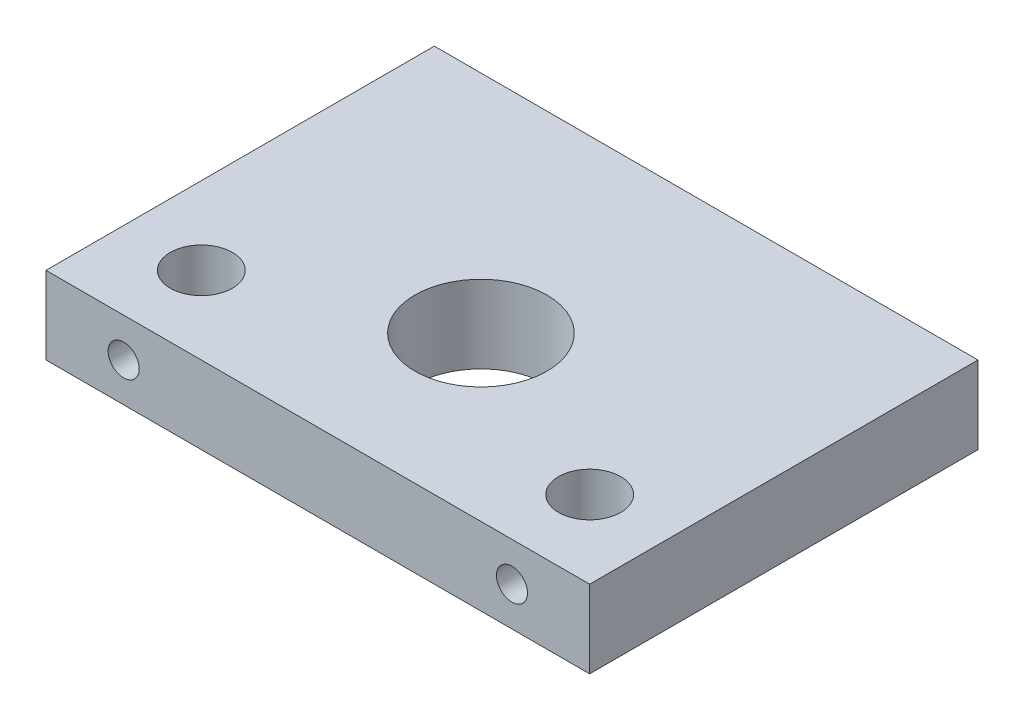
ISO-10303-21;
HEADER;
FILE_DESCRIPTION(('STEP AP214'),'2;1');
FILE_NAME('part.step','',(''),(''),'','','');
FILE_SCHEMA(('AUTOMOTIVE_DESIGN { 1 0 10303 214 1 1 1 1 }'));
ENDSEC;
DATA;
#1=APPLICATION_CONTEXT('core data for automotive mechanical design processes');
#2=APPLICATION_PROTOCOL_DEFINITION('international standard','automotive_design',2000,#1);
#3=PRODUCT_CONTEXT('',#1,'mechanical');
#4=PRODUCT('Part','Part','',(#3));
#5=PRODUCT_RELATED_PRODUCT_CATEGORY('part','',(#4));
#6=PRODUCT_DEFINITION_FORMATION('','',#4);
#7=PRODUCT_DEFINITION_CONTEXT('part definition',#1,'design');
#8=PRODUCT_DEFINITION('design','',#6,#7);
#9=PRODUCT_DEFINITION_SHAPE('','',#8);
#10=(LENGTH_UNIT() NAMED_UNIT(*) SI_UNIT(.MILLI.,.METRE.));
#11=(NAMED_UNIT(*) PLANE_ANGLE_UNIT() SI_UNIT($,.RADIAN.));
#12=(NAMED_UNIT(*) SI_UNIT($,.STERADIAN.) SOLID_ANGLE_UNIT());
#13=UNCERTAINTY_MEASURE_WITH_UNIT(LENGTH_MEASURE(1.E-05),#10,'distance_accuracy_value','');
#14=(GEOMETRIC_REPRESENTATION_CONTEXT(3) GLOBAL_UNCERTAINTY_ASSIGNED_CONTEXT((#13)) GLOBAL_UNIT_ASSIGNED_CONTEXT((#10,
#11,#12)) REPRESENTATION_CONTEXT('',''));
#15=CARTESIAN_POINT('',(0.,0.,0.));
#16=DIRECTION('',(0.,0.,1.));
#17=DIRECTION('',(1.,0.,0.));
#18=AXIS2_PLACEMENT_3D('',#15,#16,#17);
#19=CARTESIAN_POINT('',(-35.,10.,25.));
#20=DIRECTION('',(1.,0.,0.));
#21=DIRECTION('',(0.,0.,-1.));
#22=AXIS2_PLACEMENT_3D('',#19,#20,#21);
#23=PLANE('',#22);
#24=DIRECTION('',(0.,0.,1.));
#25=VECTOR('',#24,1.);
#26=CARTESIAN_POINT('',(-35.,0.,25.));
#27=LINE('',#26,#25);
#28=CARTESIAN_POINT('',(-35.,0.,-25.));
#29=VERTEX_POINT('',#28);
#30=CARTESIAN_POINT('',(-35.,0.,25.));
#31=VERTEX_POINT('',#30);
#32=EDGE_CURVE('E108',#29,#31,#27,.T.);
#33=ORIENTED_EDGE('',*,*,#32,.T.);
#34=DIRECTION('',(0.,-1.,0.));
#35=VECTOR('',#34,1.);
#36=CARTESIAN_POINT('',(-35.,10.,25.));
#37=LINE('',#36,#35);
#38=CARTESIAN_POINT('',(-35.,10.,25.));
#39=VERTEX_POINT('',#38);
#40=EDGE_CURVE('E11',#39,#31,#37,.T.);
#41=ORIENTED_EDGE('',*,*,#40,.F.);
#42=DIRECTION('',(0.,0.,1.));
#43=VECTOR('',#42,1.);
#44=CARTESIAN_POINT('',(-35.,10.,25.));
#45=LINE('',#44,#43);
#46=CARTESIAN_POINT('',(-35.,10.,-25.));
#47=VERTEX_POINT('',#46);
#48=EDGE_CURVE('E95',#47,#39,#45,.T.);
#49=ORIENTED_EDGE('',*,*,#48,.F.);
#50=DIRECTION('',(0.,-1.,0.));
#51=VECTOR('',#50,1.);
#52=CARTESIAN_POINT('',(-35.,10.,-25.));
#53=LINE('',#52,#51);
#54=EDGE_CURVE('E104',#47,#29,#53,.T.);
#55=ORIENTED_EDGE('',*,*,#54,.T.);
#56=EDGE_LOOP('',(#33,#41,#49,#55));
#57=FACE_BOUND('',#56,.T.);
#58=ADVANCED_FACE('F37',(#57),#23,.F.);
#59=CARTESIAN_POINT('',(35.,10.,25.));
#60=DIRECTION('',(0.,0.,-1.));
#61=DIRECTION('',(-1.,0.,0.));
#62=AXIS2_PLACEMENT_3D('',#59,#60,#61);
#63=PLANE('',#62);
#64=CARTESIAN_POINT('',(25.,5.,25.));
#65=DIRECTION('',(0.,0.,1.));
#66=DIRECTION('',(1.,0.,0.));
#67=AXIS2_PLACEMENT_3D('',#64,#65,#66);
#68=CIRCLE('',#67,2.);
#69=CARTESIAN_POINT('',(27.,5.,25.));
#70=VERTEX_POINT('',#69);
#71=EDGE_CURVE('E123',#70,#70,#68,.T.);
#72=ORIENTED_EDGE('',*,*,#71,.F.);
#73=EDGE_LOOP('',(#72));
#74=FACE_BOUND('',#73,.T.);
#75=CARTESIAN_POINT('',(-25.,5.00000000000002,25.));
#76=DIRECTION('',(0.,0.,1.));
#77=DIRECTION('',(-1.,0.,0.));
#78=AXIS2_PLACEMENT_3D('',#75,#76,#77);
#79=CIRCLE('',#78,2.);
#80=CARTESIAN_POINT('',(-27.,5.00000000000002,25.));
#81=VERTEX_POINT('',#80);
#82=EDGE_CURVE('E257',#81,#81,#79,.T.);
#83=ORIENTED_EDGE('',*,*,#82,.F.);
#84=EDGE_LOOP('',(#83));
#85=FACE_BOUND('',#84,.T.);
#86=DIRECTION('',(1.,0.,0.));
#87=VECTOR('',#86,1.);
#88=CARTESIAN_POINT('',(35.,0.,25.));
#89=LINE('',#88,#87);
#90=CARTESIAN_POINT('',(35.,0.,25.));
#91=VERTEX_POINT('',#90);
#92=EDGE_CURVE('E99',#31,#91,#89,.T.);
#93=ORIENTED_EDGE('',*,*,#92,.T.);
#94=DIRECTION('',(0.,-1.,0.));
#95=VECTOR('',#94,1.);
#96=CARTESIAN_POINT('',(35.,10.,25.));
#97=LINE('',#96,#95);
#98=CARTESIAN_POINT('',(35.,10.,25.));
#99=VERTEX_POINT('',#98);
#100=EDGE_CURVE('E51',#99,#91,#97,.T.);
#101=ORIENTED_EDGE('',*,*,#100,.F.);
#102=DIRECTION('',(1.,0.,0.));
#103=VECTOR('',#102,1.);
#104=CARTESIAN_POINT('',(35.,10.,25.));
#105=LINE('',#104,#103);
#106=EDGE_CURVE('E90',#39,#99,#105,.T.);
#107=ORIENTED_EDGE('',*,*,#106,.F.);
#108=ORIENTED_EDGE('',*,*,#40,.T.);
#109=EDGE_LOOP('',(#93,#101,#107,#108));
#110=FACE_BOUND('',#109,.T.);
#111=ADVANCED_FACE('F98',(#74,#85,#110),#63,.F.);
#112=CARTESIAN_POINT('',(35.,10.,25.));
#113=DIRECTION('',(-1.,0.,0.));
#114=DIRECTION('',(0.,0.,1.));
#115=AXIS2_PLACEMENT_3D('',#112,#113,#114);
#116=PLANE('',#115);
#117=DIRECTION('',(0.,0.,-1.));
#118=VECTOR('',#117,1.);
#119=CARTESIAN_POINT('',(35.,0.,25.));
#120=LINE('',#119,#118);
#121=CARTESIAN_POINT('',(35.,0.,-25.));
#122=VERTEX_POINT('',#121);
#123=EDGE_CURVE('E77',#91,#122,#120,.T.);
#124=ORIENTED_EDGE('',*,*,#123,.T.);
#125=DIRECTION('',(0.,-1.,0.));
#126=VECTOR('',#125,1.);
#127=CARTESIAN_POINT('',(35.,10.,-25.));
#128=LINE('',#127,#126);
#129=CARTESIAN_POINT('',(35.,10.,-25.));
#130=VERTEX_POINT('',#129);
#131=EDGE_CURVE('E100',#130,#122,#128,.T.);
#132=ORIENTED_EDGE('',*,*,#131,.F.);
#133=DIRECTION('',(0.,0.,-1.));
#134=VECTOR('',#133,1.);
#135=CARTESIAN_POINT('',(35.,10.,25.));
#136=LINE('',#135,#134);
#137=EDGE_CURVE('E93',#99,#130,#136,.T.);
#138=ORIENTED_EDGE('',*,*,#137,.F.);
#139=ORIENTED_EDGE('',*,*,#100,.T.);
#140=EDGE_LOOP('',(#124,#132,#138,#139));
#141=FACE_BOUND('',#140,.T.);
#142=ADVANCED_FACE('F102',(#141),#116,.F.);
#143=CARTESIAN_POINT('',(35.,10.,-25.));
#144=DIRECTION('',(0.,0.,1.));
#145=DIRECTION('',(1.,0.,0.));
#146=AXIS2_PLACEMENT_3D('',#143,#144,#145);
#147=PLANE('',#146);
#148=DIRECTION('',(-1.,0.,0.));
#149=VECTOR('',#148,1.);
#150=CARTESIAN_POINT('',(35.,0.,-25.));
#151=LINE('',#150,#149);
#152=EDGE_CURVE('E83',#122,#29,#151,.T.);
#153=ORIENTED_EDGE('',*,*,#152,.T.);
#154=ORIENTED_EDGE('',*,*,#54,.F.);
#155=DIRECTION('',(-1.,0.,0.));
#156=VECTOR('',#155,1.);
#157=CARTESIAN_POINT('',(35.,10.,-25.));
#158=LINE('',#157,#156);
#159=EDGE_CURVE('E60',#130,#47,#158,.T.);
#160=ORIENTED_EDGE('',*,*,#159,.F.);
#161=ORIENTED_EDGE('',*,*,#131,.T.);
#162=EDGE_LOOP('',(#153,#154,#160,#161));
#163=FACE_BOUND('',#162,.T.);
#164=ADVANCED_FACE('F160',(#163),#147,.F.);
#165=CARTESIAN_POINT('',(0.,10.,0.));
#166=DIRECTION('',(0.,1.,0.));
#167=DIRECTION('',(0.,0.,1.));
#168=AXIS2_PLACEMENT_3D('',#165,#166,#167);
#169=PLANE('',#168);
#170=CARTESIAN_POINT('',(5.15281762734335E-13,10.,4.));
#171=DIRECTION('',(0.,-1.,0.));
#172=DIRECTION('',(0.,0.,-1.));
#173=AXIS2_PLACEMENT_3D('',#170,#171,#172);
#174=CIRCLE('',#173,8.50000000000002);
#175=CARTESIAN_POINT('',(5.15281762734335E-13,10.,-4.50000000000001));
#176=VERTEX_POINT('',#175);
#177=EDGE_CURVE('E260',#176,#176,#174,.T.);
#178=ORIENTED_EDGE('',*,*,#177,.T.);
#179=EDGE_LOOP('',(#178));
#180=FACE_BOUND('',#179,.T.);
#181=CARTESIAN_POINT('',(-25.,10.,15.));
#182=DIRECTION('',(0.,-1.,0.));
#183=DIRECTION('',(0.,0.,-1.));
#184=AXIS2_PLACEMENT_3D('',#181,#182,#183);
#185=CIRCLE('',#184,4.);
#186=CARTESIAN_POINT('',(-25.,10.,11.));
#187=VERTEX_POINT('',#186);
#188=EDGE_CURVE('E111',#187,#187,#185,.T.);
#189=ORIENTED_EDGE('',*,*,#188,.T.);
#190=EDGE_LOOP('',(#189));
#191=FACE_BOUND('',#190,.T.);
#192=CARTESIAN_POINT('',(25.,10.,15.));
#193=DIRECTION('',(0.,-1.,0.));
#194=DIRECTION('',(0.,0.,1.));
#195=AXIS2_PLACEMENT_3D('',#192,#193,#194);
#196=CIRCLE('',#195,4.);
#197=CARTESIAN_POINT('',(25.,10.,19.));
#198=VERTEX_POINT('',#197);
#199=EDGE_CURVE('E239',#198,#198,#196,.T.);
#200=ORIENTED_EDGE('',*,*,#199,.T.);
#201=EDGE_LOOP('',(#200));
#202=FACE_BOUND('',#201,.T.);
#203=ORIENTED_EDGE('',*,*,#48,.T.);
#204=ORIENTED_EDGE('',*,*,#106,.T.);
#205=ORIENTED_EDGE('',*,*,#137,.T.);
#206=ORIENTED_EDGE('',*,*,#159,.T.);
#207=EDGE_LOOP('',(#203,#204,#205,#206));
#208=FACE_BOUND('',#207,.T.);
#209=ADVANCED_FACE('F91',(#180,#191,#202,#208),#169,.T.);
#210=CARTESIAN_POINT('',(0.,0.,0.));
#211=DIRECTION('',(0.,1.,0.));
#212=DIRECTION('',(0.,0.,1.));
#213=AXIS2_PLACEMENT_3D('',#210,#211,#212);
#214=PLANE('',#213);
#215=CARTESIAN_POINT('',(5.15281762734335E-13,0.,4.));
#216=DIRECTION('',(0.,-1.,0.));
#217=DIRECTION('',(0.,0.,-1.));
#218=AXIS2_PLACEMENT_3D('',#215,#216,#217);
#219=CIRCLE('',#218,8.50000000000002);
#220=CARTESIAN_POINT('',(5.15281762734335E-13,0.,-4.50000000000001));
#221=VERTEX_POINT('',#220);
#222=EDGE_CURVE('E263',#221,#221,#219,.T.);
#223=ORIENTED_EDGE('',*,*,#222,.F.);
#224=EDGE_LOOP('',(#223));
#225=FACE_BOUND('',#224,.T.);
#226=CARTESIAN_POINT('',(-25.,0.,15.));
#227=DIRECTION('',(0.,-1.,0.));
#228=DIRECTION('',(0.,0.,-1.));
#229=AXIS2_PLACEMENT_3D('',#226,#227,#228);
#230=CIRCLE('',#229,4.);
#231=CARTESIAN_POINT('',(-25.,0.,11.));
#232=VERTEX_POINT('',#231);
#233=EDGE_CURVE('E238',#232,#232,#230,.T.);
#234=ORIENTED_EDGE('',*,*,#233,.F.);
#235=EDGE_LOOP('',(#234));
#236=FACE_BOUND('',#235,.T.);
#237=CARTESIAN_POINT('',(25.,0.,15.));
#238=DIRECTION('',(0.,-1.,0.));
#239=DIRECTION('',(0.,0.,1.));
#240=AXIS2_PLACEMENT_3D('',#237,#238,#239);
#241=CIRCLE('',#240,4.);
#242=CARTESIAN_POINT('',(25.,0.,19.));
#243=VERTEX_POINT('',#242);
#244=EDGE_CURVE('E243',#243,#243,#241,.T.);
#245=ORIENTED_EDGE('',*,*,#244,.F.);
#246=EDGE_LOOP('',(#245));
#247=FACE_BOUND('',#246,.T.);
#248=ORIENTED_EDGE('',*,*,#32,.F.);
#249=ORIENTED_EDGE('',*,*,#152,.F.);
#250=ORIENTED_EDGE('',*,*,#123,.F.);
#251=ORIENTED_EDGE('',*,*,#92,.F.);
#252=EDGE_LOOP('',(#248,#249,#250,#251));
#253=FACE_BOUND('',#252,.T.);
#254=ADVANCED_FACE('F150',(#225,#236,#247,#253),#214,.F.);
#255=CARTESIAN_POINT('',(25.,10.,15.));
#256=DIRECTION('',(0.,-1.,0.));
#257=DIRECTION('',(0.,0.,-1.));
#258=AXIS2_PLACEMENT_3D('',#255,#256,#257);
#259=CYLINDRICAL_SURFACE('',#258,4.);
#260=CARTESIAN_POINT('',(27.,5.,18.4641016151378));
#261=CARTESIAN_POINT('',(26.9999915874878,5.10421320547434,18.4641118571589));
#262=CARTESIAN_POINT('',(26.9917996361044,5.2085621765338,18.4688763354498));
#263=CARTESIAN_POINT('',(26.9594467258005,5.4140551772306,18.4872470166907));
#264=CARTESIAN_POINT('',(26.9352522109566,5.51519200324776,18.5008717978818));
#265=CARTESIAN_POINT('',(26.8721998159803,5.71090315644693,18.5349870149));
#266=CARTESIAN_POINT('',(26.8334198829596,5.80550925884925,18.5554408906917));
#267=CARTESIAN_POINT('',(26.7425350724514,5.98684845047615,18.6008532729113));
#268=CARTESIAN_POINT('',(26.6904294741014,6.07358111343677,18.6258120230125));
#269=CARTESIAN_POINT('',(26.569333074538,6.24461144313338,18.6799373881929));
#270=CARTESIAN_POINT('',(26.4993040705353,6.32811826759177,18.709281274651));
#271=CARTESIAN_POINT('',(26.346507616982,6.4828167805706,18.7674396538212));
#272=CARTESIAN_POINT('',(26.2637338520484,6.55400232620397,18.7962538761026));
#273=CARTESIAN_POINT('',(26.0809791263127,6.68673430118849,18.8524295396166));
#274=CARTESIAN_POINT('',(25.9802143778872,6.74730753542331,18.8795621285125));
#275=CARTESIAN_POINT('',(25.7683140533369,6.85028170678709,18.9270151218417));
#276=CARTESIAN_POINT('',(25.657185076312,6.8926941123508,18.9473398236363));
#277=CARTESIAN_POINT('',(25.4360898878188,6.95500932253117,18.9776092249205));
#278=CARTESIAN_POINT('',(25.3266035809688,6.9762990526921,18.9881896044274));
#279=CARTESIAN_POINT('',(25.1051412574046,7.00033223736903,19.0001516769118));
#280=CARTESIAN_POINT('',(24.9931667883148,7.00308691359628,19.0015389356894));
#281=CARTESIAN_POINT('',(24.7803349511504,6.99050665205486,18.9952596383313));
#282=CARTESIAN_POINT('',(24.6793576016459,6.97672396895636,18.9883699178438));
#283=CARTESIAN_POINT('',(24.4813724561639,6.93423831219188,18.9674849051944));
#284=CARTESIAN_POINT('',(24.3843649578123,6.90553422204787,18.9534890813277));
#285=CARTESIAN_POINT('',(24.1953812168607,6.83383486782005,18.9194316657533));
#286=CARTESIAN_POINT('',(24.1034931529696,6.79064737365578,18.899288830584));
#287=CARTESIAN_POINT('',(23.9280463969734,6.6914731675971,18.8547529197337));
#288=CARTESIAN_POINT('',(23.8444907023227,6.63548187339532,18.8303583231497));
#289=CARTESIAN_POINT('',(23.6796526782036,6.50620929693394,18.7768878879846));
#290=CARTESIAN_POINT('',(23.5993318499413,6.43179394334797,18.7475875199635));
#291=CARTESIAN_POINT('',(23.4517912594044,6.27082055013966,18.6890868117362));
#292=CARTESIAN_POINT('',(23.3845815768515,6.18425325545188,18.6598865653126));
#293=CARTESIAN_POINT('',(23.2609893307156,5.99470361515183,18.6028831218497));
#294=CARTESIAN_POINT('',(23.2055653700439,5.89102795389158,18.5752863998142));
#295=CARTESIAN_POINT('',(23.1133617739975,5.67412465728201,18.5275090055715));
#296=CARTESIAN_POINT('',(23.0765626835782,5.56090713396488,18.5073206009214));
#297=CARTESIAN_POINT('',(23.0256395779499,5.33757097743442,18.4788927163407));
#298=CARTESIAN_POINT('',(23.0099497557601,5.2279177619129,18.4698331169699));
#299=CARTESIAN_POINT('',(22.9969661067772,5.00719731696691,18.4623583872322));
#300=CARTESIAN_POINT('',(22.9996592853699,4.89613114176041,18.4639357377863));
#301=CARTESIAN_POINT('',(23.0219279133121,4.68869216284257,18.4766867308117));
#302=CARTESIAN_POINT('',(23.0396243665751,4.59204109778422,18.4867917501331));
#303=CARTESIAN_POINT('',(23.0886074307351,4.40326442745801,18.5138804310268));
#304=CARTESIAN_POINT('',(23.1198984427527,4.31114029850652,18.5308663201007));
#305=CARTESIAN_POINT('',(23.1967048227903,4.12917733819489,18.5707244415931));
#306=CARTESIAN_POINT('',(23.2428118726147,4.03964196629395,18.5938328648613));
#307=CARTESIAN_POINT('',(23.3474258719682,3.86906145692096,18.643122389945));
#308=CARTESIAN_POINT('',(23.405939191335,3.78802071296949,18.669305067103));
#309=CARTESIAN_POINT('',(23.5423256656029,3.62604246495734,18.7257599691267));
#310=CARTESIAN_POINT('',(23.6217094553725,3.54640569858222,18.7561316630857));
#311=CARTESIAN_POINT('',(23.793191009201,3.40117552399527,18.814684699558));
#312=CARTESIAN_POINT('',(23.8852930506801,3.33558685947316,18.8428653001546));
#313=CARTESIAN_POINT('',(24.0829292748919,3.21885254816729,18.8948272338187));
#314=CARTESIAN_POINT('',(24.1887538048875,3.16813376383323,18.9184728334389));
#315=CARTESIAN_POINT('',(24.4089552706821,3.08572419203039,18.9576670991878));
#316=CARTESIAN_POINT('',(24.5233245970824,3.0540166963159,18.973222873534));
#317=CARTESIAN_POINT('',(24.7460406354602,3.01326287251486,18.9933501636318));
#318=CARTESIAN_POINT('',(24.8539771127317,3.00240425133572,18.9987985581427));
#319=CARTESIAN_POINT('',(25.07025197147,2.99831346600433,19.0008426075238));
#320=CARTESIAN_POINT('',(25.1785901989816,3.00507513147113,18.9974413614164));
#321=CARTESIAN_POINT('',(25.3850759861369,3.03483282431641,18.9826793766851));
#322=CARTESIAN_POINT('',(25.4834246410574,3.05672973730905,18.9718578930944));
#323=CARTESIAN_POINT('',(25.6748918989316,3.11465395980667,18.9438418735339));
#324=CARTESIAN_POINT('',(25.7680097496698,3.15068329570691,18.9266464236443));
#325=CARTESIAN_POINT('',(25.9508468335967,3.2374542549914,18.8865186139318));
#326=CARTESIAN_POINT('',(26.0402503657229,3.28875921975186,18.863372340054));
#327=CARTESIAN_POINT('',(26.2095492032683,3.40391528811809,18.8137626667603));
#328=CARTESIAN_POINT('',(26.2894401144432,3.46777215410157,18.7872977458343));
#329=CARTESIAN_POINT('',(26.445828338595,3.61359663555941,18.7305721884058));
#330=CARTESIAN_POINT('',(26.521196658792,3.69673418080028,18.7001959172608));
#331=CARTESIAN_POINT('',(26.6573252839401,3.87489222830609,18.6412615862857));
#332=CARTESIAN_POINT('',(26.7180726652124,3.96992313136051,18.6127051513079));
#333=CARTESIAN_POINT('',(26.8248671471681,4.17330889413024,18.5599918625675));
#334=CARTESIAN_POINT('',(26.8703890238191,4.28198991073527,18.5360025626854));
#335=CARTESIAN_POINT('',(26.923959295048,4.45057811963094,18.5069621813237));
#336=CARTESIAN_POINT('',(26.9393566614797,4.50764782059067,18.498443893294));
#337=CARTESIAN_POINT('',(26.9650806980504,4.62323255750019,18.4840605932354));
#338=CARTESIAN_POINT('',(26.9754109134328,4.68174655275425,18.4781937263605));
#339=CARTESIAN_POINT('',(26.9887293296122,4.78360078924729,18.4705902366876));
#340=CARTESIAN_POINT('',(26.9929509198379,4.82673305725007,18.4681638973182));
#341=CARTESIAN_POINT('',(26.9985881003561,4.91323569309289,18.4649174004518));
#342=CARTESIAN_POINT('',(27.0000035029333,4.9566060766667,18.4640973504049));
#343=CARTESIAN_POINT('',(27.,5.,18.4641016151378));
#344=B_SPLINE_CURVE_WITH_KNOTS('',3,(#260,#261,#262,#263,#264,#265,#266,#267,#268,#269,#270,
#271,#272,#273,#274,#275,#276,#277,#278,#279,#280,#281,#282,#283,#284,#285,#286,#287,#288,#289,
#290,#291,#292,#293,#294,#295,#296,#297,#298,#299,#300,#301,#302,#303,#304,#305,#306,#307,#308,
#309,#310,#311,#312,#313,#314,#315,#316,#317,#318,#319,#320,#321,#322,#323,#324,#325,#326,#327,
#328,#329,#330,#331,#332,#333,#334,#335,#336,#337,#338,#339,#340,#341,#342,#343),.UNSPECIFIED.,
.T.,.F.,(4,2,2,2,2,2,2,2,2,2,2,2,2,2,2,2,2,2,2,2,2,2,2,2,2,2,2,2,2,2,2,2,2,2,2,2,2,2,2,2,2,4),
(0.,0.312464245189431,0.625585785649608,0.937057191861534,1.24854545093096,1.58572462503713,
1.92307142172808,2.28315784481593,2.64301653931848,2.97726969939936,3.31132047376146,
3.61632194973143,3.92134625038977,4.2305906946636,4.5399459870461,4.87854382917848,
5.21740096495903,5.57777683462963,5.93777548427476,6.2692458171249,6.60048186380812,
6.89548366852117,7.19058104876192,7.49934592816241,7.80826972444161,8.15613487165292,
8.5041172996047,8.86128362829998,9.2181355962161,9.5422454078304,9.8662417359201,
10.1688884974705,10.4715786702809,10.7872150144301,11.102996602055,11.450204837042,
11.7977188569437,12.1562149808128,12.3351395323571,12.5139387197526,12.6440387634036,
12.7741475095882),.UNSPECIFIED.);
#345=CARTESIAN_POINT('',(27.,5.,18.4641016151378));
#346=VERTEX_POINT('',#345);
#347=EDGE_CURVE('E40',#346,#346,#344,.T.);
#348=ORIENTED_EDGE('',*,*,#347,.T.);
#349=EDGE_LOOP('',(#348));
#350=FACE_BOUND('',#349,.T.);
#351=ORIENTED_EDGE('',*,*,#199,.F.);
#352=EDGE_LOOP('',(#351));
#353=FACE_BOUND('',#352,.T.);
#354=ORIENTED_EDGE('',*,*,#244,.T.);
#355=EDGE_LOOP('',(#354));
#356=FACE_BOUND('',#355,.T.);
#357=ADVANCED_FACE('F152',(#350,#353,#356),#259,.F.);
#358=CARTESIAN_POINT('',(-25.,10.,15.));
#359=DIRECTION('',(0.,-1.,0.));
#360=DIRECTION('',(0.,0.,-1.));
#361=AXIS2_PLACEMENT_3D('',#358,#359,#360);
#362=CYLINDRICAL_SURFACE('',#361,4.);
#363=CARTESIAN_POINT('',(-23.,5.00000000000002,18.4641016151378));
#364=CARTESIAN_POINT('',(-23.0000084125122,5.10421320547437,18.4641118571589));
#365=CARTESIAN_POINT('',(-23.0082003638956,5.20856217653382,18.4688763354498));
#366=CARTESIAN_POINT('',(-23.0405532741995,5.41405517723063,18.4872470166907));
#367=CARTESIAN_POINT('',(-23.0647477890434,5.51519200324779,18.5008717978818));
#368=CARTESIAN_POINT('',(-23.1278001840197,5.71090315644696,18.5349870149));
#369=CARTESIAN_POINT('',(-23.1665801170404,5.80550925884927,18.5554408906917));
#370=CARTESIAN_POINT('',(-23.2574649275486,5.98684845047618,18.6008532729113));
#371=CARTESIAN_POINT('',(-23.3095705258986,6.0735811134368,18.6258120230125));
#372=CARTESIAN_POINT('',(-23.430666925462,6.24461144313341,18.6799373881929));
#373=CARTESIAN_POINT('',(-23.5006959294647,6.3281182675918,18.709281274651));
#374=CARTESIAN_POINT('',(-23.653492383018,6.48281678057063,18.7674396538212));
#375=CARTESIAN_POINT('',(-23.7362661479516,6.554002326204,18.7962538761026));
#376=CARTESIAN_POINT('',(-23.9190208736874,6.68673430118852,18.8524295396166));
#377=CARTESIAN_POINT('',(-24.0197856221128,6.74730753542333,18.8795621285125));
#378=CARTESIAN_POINT('',(-24.2316859466631,6.85028170678711,18.9270151218417));
#379=CARTESIAN_POINT('',(-24.342814923688,6.89269411235082,18.9473398236363));
#380=CARTESIAN_POINT('',(-24.5639101121812,6.9550093225312,18.9776092249205));
#381=CARTESIAN_POINT('',(-24.6733964190312,6.97629905269213,18.9881896044274));
#382=CARTESIAN_POINT('',(-24.8948587425955,7.00033223736906,19.0001516769118));
#383=CARTESIAN_POINT('',(-25.0068332116852,7.00308691359631,19.0015389356894));
#384=CARTESIAN_POINT('',(-25.2196650488496,6.99050665205488,18.9952596383312));
#385=CARTESIAN_POINT('',(-25.3206423983541,6.97672396895639,18.9883699178438));
#386=CARTESIAN_POINT('',(-25.5186275438361,6.9342383121919,18.9674849051944));
#387=CARTESIAN_POINT('',(-25.6156350421877,6.9055342220479,18.9534890813277));
#388=CARTESIAN_POINT('',(-25.8046187831393,6.83383486782007,18.9194316657533));
#389=CARTESIAN_POINT('',(-25.8965068470304,6.7906473736558,18.899288830584));
#390=CARTESIAN_POINT('',(-26.0719536030266,6.69147316759713,18.8547529197337));
#391=CARTESIAN_POINT('',(-26.1555092976773,6.63548187339535,18.8303583231497));
#392=CARTESIAN_POINT('',(-26.3203473217964,6.50620929693397,18.7768878879846));
#393=CARTESIAN_POINT('',(-26.4006681500587,6.431793943348,18.7475875199635));
#394=CARTESIAN_POINT('',(-26.5482087405956,6.27082055013968,18.6890868117362));
#395=CARTESIAN_POINT('',(-26.6154184231485,6.1842532554519,18.6598865653126));
#396=CARTESIAN_POINT('',(-26.7390106692844,5.99470361515185,18.6028831218497));
#397=CARTESIAN_POINT('',(-26.7944346299561,5.8910279538916,18.5752863998142));
#398=CARTESIAN_POINT('',(-26.8866382260025,5.67412465728203,18.5275090055715));
#399=CARTESIAN_POINT('',(-26.9234373164218,5.5609071339649,18.5073206009214));
#400=CARTESIAN_POINT('',(-26.9743604220501,5.33757097743444,18.4788927163407));
#401=CARTESIAN_POINT('',(-26.99005024424,5.22791776191293,18.4698331169699));
#402=CARTESIAN_POINT('',(-27.0030338932229,5.00719731696693,18.4623583872322));
#403=CARTESIAN_POINT('',(-27.0003407146301,4.89613114176043,18.4639357377862));
#404=CARTESIAN_POINT('',(-26.9780720866879,4.68869216284259,18.4766867308117));
#405=CARTESIAN_POINT('',(-26.9603756334249,4.59204109778424,18.4867917501331));
#406=CARTESIAN_POINT('',(-26.9113925692649,4.40326442745804,18.5138804310268));
#407=CARTESIAN_POINT('',(-26.8801015572473,4.31114029850654,18.5308663201007));
#408=CARTESIAN_POINT('',(-26.8032951772097,4.12917733819491,18.5707244415931));
#409=CARTESIAN_POINT('',(-26.7571881273853,4.03964196629398,18.5938328648613));
#410=CARTESIAN_POINT('',(-26.6525741280318,3.86906145692099,18.643122389945));
#411=CARTESIAN_POINT('',(-26.594060808665,3.78802071296952,18.669305067103));
#412=CARTESIAN_POINT('',(-26.4576743343971,3.62604246495737,18.7257599691267));
#413=CARTESIAN_POINT('',(-26.3782905446275,3.54640569858225,18.7561316630857));
#414=CARTESIAN_POINT('',(-26.206808990799,3.4011755239953,18.814684699558));
#415=CARTESIAN_POINT('',(-26.1147069493199,3.33558685947319,18.8428653001546));
#416=CARTESIAN_POINT('',(-25.9170707251081,3.21885254816732,18.8948272338187));
#417=CARTESIAN_POINT('',(-25.8112461951125,3.16813376383326,18.9184728334388));
#418=CARTESIAN_POINT('',(-25.5910447293179,3.08572419203041,18.9576670991878));
#419=CARTESIAN_POINT('',(-25.4766754029177,3.05401669631593,18.973222873534));
#420=CARTESIAN_POINT('',(-25.2539593645398,3.01326287251489,18.9933501636317));
#421=CARTESIAN_POINT('',(-25.1460228872683,3.00240425133575,18.9987985581427));
#422=CARTESIAN_POINT('',(-24.9297480285301,2.99831346600435,19.0008426075237));
#423=CARTESIAN_POINT('',(-24.8214098010184,3.00507513147116,18.9974413614163));
#424=CARTESIAN_POINT('',(-24.6149240138631,3.03483282431643,18.9826793766851));
#425=CARTESIAN_POINT('',(-24.5165753589426,3.05672973730908,18.9718578930944));
#426=CARTESIAN_POINT('',(-24.3251081010684,3.11465395980669,18.9438418735339));
#427=CARTESIAN_POINT('',(-24.2319902503302,3.15068329570694,18.9266464236442));
#428=CARTESIAN_POINT('',(-24.0491531664033,3.23745425499143,18.8865186139318));
#429=CARTESIAN_POINT('',(-23.9597496342771,3.28875921975188,18.863372340054));
#430=CARTESIAN_POINT('',(-23.7904507967317,3.40391528811812,18.8137626667603));
#431=CARTESIAN_POINT('',(-23.7105598855568,3.46777215410159,18.7872977458343));
#432=CARTESIAN_POINT('',(-23.5541716614051,3.61359663555944,18.7305721884058));
#433=CARTESIAN_POINT('',(-23.478803341208,3.69673418080031,18.7001959172608));
#434=CARTESIAN_POINT('',(-23.3426747160599,3.87489222830611,18.6412615862857));
#435=CARTESIAN_POINT('',(-23.2819273347876,3.96992313136054,18.6127051513079));
#436=CARTESIAN_POINT('',(-23.1751328528319,4.17330889413027,18.5599918625675));
#437=CARTESIAN_POINT('',(-23.1296109761809,4.2819899107353,18.5360025626854));
#438=CARTESIAN_POINT('',(-23.076040704952,4.45057811963097,18.5069621813237));
#439=CARTESIAN_POINT('',(-23.0606433385203,4.5076478205907,18.498443893294));
#440=CARTESIAN_POINT('',(-23.0349193019496,4.62323255750021,18.4840605932354));
#441=CARTESIAN_POINT('',(-23.0245890865672,4.68174655275427,18.4781937263605));
#442=CARTESIAN_POINT('',(-23.0112706703878,4.78360078924731,18.4705902366876));
#443=CARTESIAN_POINT('',(-23.0070490801621,4.8267330572501,18.4681638973182));
#444=CARTESIAN_POINT('',(-23.0014118996439,4.91323569309292,18.4649174004518));
#445=CARTESIAN_POINT('',(-22.9999964970667,4.95660607666672,18.4640973504049));
#446=CARTESIAN_POINT('',(-23.,5.00000000000002,18.4641016151378));
#447=B_SPLINE_CURVE_WITH_KNOTS('',3,(#363,#364,#365,#366,#367,#368,#369,#370,#371,#372,#373,
#374,#375,#376,#377,#378,#379,#380,#381,#382,#383,#384,#385,#386,#387,#388,#389,#390,#391,#392,
#393,#394,#395,#396,#397,#398,#399,#400,#401,#402,#403,#404,#405,#406,#407,#408,#409,#410,#411,
#412,#413,#414,#415,#416,#417,#418,#419,#420,#421,#422,#423,#424,#425,#426,#427,#428,#429,#430,
#431,#432,#433,#434,#435,#436,#437,#438,#439,#440,#441,#442,#443,#444,#445,#446),.UNSPECIFIED.,
.T.,.F.,(4,2,2,2,2,2,2,2,2,2,2,2,2,2,2,2,2,2,2,2,2,2,2,2,2,2,2,2,2,2,2,2,2,2,2,2,2,2,2,2,2,4),
(0.,0.312464245189433,0.625585785649609,0.937057191861534,1.24854545093096,1.58572462503713,
1.92307142172809,2.28315784481593,2.64301653931849,2.97726969939937,3.31132047376146,
3.61632194973143,3.92134625038977,4.2305906946636,4.5399459870461,4.87854382917848,
5.21740096495904,5.57777683462963,5.93777548427476,6.2692458171249,6.60048186380813,
6.89548366852118,7.19058104876193,7.49934592816242,7.80826972444161,8.15613487165292,
8.50411729960471,8.86128362829998,9.2181355962161,9.5422454078304,9.8662417359201,
10.1688884974705,10.4715786702809,10.7872150144301,11.102996602055,11.450204837042,
11.7977188569437,12.1562149808128,12.3351395323571,12.5139387197526,12.6440387634036,
12.7741475095882),.UNSPECIFIED.);
#448=CARTESIAN_POINT('',(-23.,5.00000000000002,18.4641016151378));
#449=VERTEX_POINT('',#448);
#450=EDGE_CURVE('E116',#449,#449,#447,.T.);
#451=ORIENTED_EDGE('',*,*,#450,.T.);
#452=EDGE_LOOP('',(#451));
#453=FACE_BOUND('',#452,.T.);
#454=ORIENTED_EDGE('',*,*,#188,.F.);
#455=EDGE_LOOP('',(#454));
#456=FACE_BOUND('',#455,.T.);
#457=ORIENTED_EDGE('',*,*,#233,.T.);
#458=EDGE_LOOP('',(#457));
#459=FACE_BOUND('',#458,.T.);
#460=ADVANCED_FACE('F124',(#453,#456,#459),#362,.F.);
#461=CARTESIAN_POINT('',(-25.,5.00000000000002,15.));
#462=DIRECTION('',(0.,0.,1.));
#463=DIRECTION('',(1.,0.,0.));
#464=AXIS2_PLACEMENT_3D('',#461,#462,#463);
#465=CYLINDRICAL_SURFACE('',#464,2.);
#466=ORIENTED_EDGE('',*,*,#82,.T.);
#467=EDGE_LOOP('',(#466));
#468=FACE_BOUND('',#467,.T.);
#469=ORIENTED_EDGE('',*,*,#450,.F.);
#470=EDGE_LOOP('',(#469));
#471=FACE_BOUND('',#470,.T.);
#472=ADVANCED_FACE('F126',(#468,#471),#465,.F.);
#473=CARTESIAN_POINT('',(25.,5.,15.));
#474=DIRECTION('',(0.,0.,1.));
#475=DIRECTION('',(1.,0.,0.));
#476=AXIS2_PLACEMENT_3D('',#473,#474,#475);
#477=CYLINDRICAL_SURFACE('',#476,2.);
#478=ORIENTED_EDGE('',*,*,#71,.T.);
#479=EDGE_LOOP('',(#478));
#480=FACE_BOUND('',#479,.T.);
#481=ORIENTED_EDGE('',*,*,#347,.F.);
#482=EDGE_LOOP('',(#481));
#483=FACE_BOUND('',#482,.T.);
#484=ADVANCED_FACE('F129',(#480,#483),#477,.F.);
#485=CARTESIAN_POINT('',(5.15281762734335E-13,10.,4.));
#486=DIRECTION('',(0.,-1.,0.));
#487=DIRECTION('',(0.,0.,-1.));
#488=AXIS2_PLACEMENT_3D('',#485,#486,#487);
#489=CYLINDRICAL_SURFACE('',#488,8.50000000000002);
#490=ORIENTED_EDGE('',*,*,#177,.F.);
#491=EDGE_LOOP('',(#490));
#492=FACE_BOUND('',#491,.T.);
#493=ORIENTED_EDGE('',*,*,#222,.T.);
#494=EDGE_LOOP('',(#493));
#495=FACE_BOUND('',#494,.T.);
#496=ADVANCED_FACE('F134',(#492,#495),#489,.F.);
#497=CLOSED_SHELL('',(#58,#111,#142,#164,#209,#254,#357,#460,#472,#484,#496));
#498=MANIFOLD_SOLID_BREP('B2',#497);
#499=ADVANCED_BREP_SHAPE_REPRESENTATION('',(#18,#498),#14);
#500=SHAPE_DEFINITION_REPRESENTATION(#9,#499);
ENDSEC;
END-ISO-10303-21;
